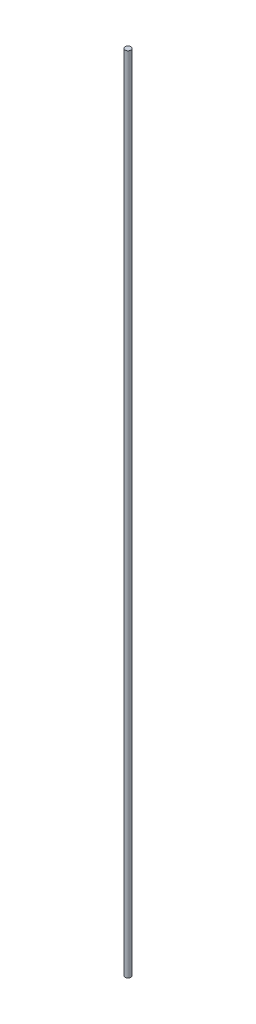
ISO-10303-21;
HEADER;
FILE_DESCRIPTION(('STEP AP214'),'2;1');
FILE_NAME('part.step','',(''),(''),'','','');
FILE_SCHEMA(('AUTOMOTIVE_DESIGN { 1 0 10303 214 1 1 1 1 }'));
ENDSEC;
DATA;
#1=APPLICATION_CONTEXT('core data for automotive mechanical design processes');
#2=APPLICATION_PROTOCOL_DEFINITION('international standard','automotive_design',2000,#1);
#3=PRODUCT_CONTEXT('',#1,'mechanical');
#4=PRODUCT('Part','Part','',(#3));
#5=PRODUCT_RELATED_PRODUCT_CATEGORY('part','',(#4));
#6=PRODUCT_DEFINITION_FORMATION('','',#4);
#7=PRODUCT_DEFINITION_CONTEXT('part definition',#1,'design');
#8=PRODUCT_DEFINITION('design','',#6,#7);
#9=PRODUCT_DEFINITION_SHAPE('','',#8);
#10=(LENGTH_UNIT() NAMED_UNIT(*) SI_UNIT(.MILLI.,.METRE.));
#11=(NAMED_UNIT(*) PLANE_ANGLE_UNIT() SI_UNIT($,.RADIAN.));
#12=(NAMED_UNIT(*) SI_UNIT($,.STERADIAN.) SOLID_ANGLE_UNIT());
#13=UNCERTAINTY_MEASURE_WITH_UNIT(LENGTH_MEASURE(1.E-05),#10,'distance_accuracy_value','');
#14=(GEOMETRIC_REPRESENTATION_CONTEXT(3) GLOBAL_UNCERTAINTY_ASSIGNED_CONTEXT((#13)) GLOBAL_UNIT_ASSIGNED_CONTEXT((#10,
#11,#12)) REPRESENTATION_CONTEXT('',''));
#15=CARTESIAN_POINT('',(0.,0.,0.));
#16=DIRECTION('',(0.,0.,1.));
#17=DIRECTION('',(1.,0.,0.));
#18=AXIS2_PLACEMENT_3D('',#15,#16,#17);
#19=CARTESIAN_POINT('',(0.,1092.5,0.));
#20=DIRECTION('',(0.,-1.,0.));
#21=DIRECTION('',(0.,0.,-1.));
#22=AXIS2_PLACEMENT_3D('',#19,#20,#21);
#23=CYLINDRICAL_SURFACE('',#22,4.);
#24=CARTESIAN_POINT('',(0.,1092.5,0.));
#25=DIRECTION('',(0.,1.,0.));
#26=DIRECTION('',(0.,0.,1.));
#27=AXIS2_PLACEMENT_3D('',#24,#25,#26);
#28=CIRCLE('',#27,4.);
#29=CARTESIAN_POINT('',(0.,1092.5,4.));
#30=VERTEX_POINT('',#29);
#31=EDGE_CURVE('E10',#30,#30,#28,.T.);
#32=ORIENTED_EDGE('',*,*,#31,.F.);
#33=EDGE_LOOP('',(#32));
#34=FACE_BOUND('',#33,.T.);
#35=CARTESIAN_POINT('',(0.,0.,0.));
#36=DIRECTION('',(0.,1.,0.));
#37=DIRECTION('',(0.,0.,1.));
#38=AXIS2_PLACEMENT_3D('',#35,#36,#37);
#39=CIRCLE('',#38,4.);
#40=CARTESIAN_POINT('',(0.,0.,4.));
#41=VERTEX_POINT('',#40);
#42=EDGE_CURVE('E36',#41,#41,#39,.T.);
#43=ORIENTED_EDGE('',*,*,#42,.T.);
#44=EDGE_LOOP('',(#43));
#45=FACE_BOUND('',#44,.T.);
#46=ADVANCED_FACE('F33',(#34,#45),#23,.T.);
#47=CARTESIAN_POINT('',(0.,1092.5,0.));
#48=DIRECTION('',(0.,1.,0.));
#49=DIRECTION('',(0.,0.,1.));
#50=AXIS2_PLACEMENT_3D('',#47,#48,#49);
#51=PLANE('',#50);
#52=ORIENTED_EDGE('',*,*,#31,.T.);
#53=EDGE_LOOP('',(#52));
#54=FACE_BOUND('',#53,.T.);
#55=ADVANCED_FACE('F48',(#54),#51,.T.);
#56=CARTESIAN_POINT('',(0.,0.,0.));
#57=DIRECTION('',(0.,1.,0.));
#58=DIRECTION('',(0.,0.,1.));
#59=AXIS2_PLACEMENT_3D('',#56,#57,#58);
#60=PLANE('',#59);
#61=ORIENTED_EDGE('',*,*,#42,.F.);
#62=EDGE_LOOP('',(#61));
#63=FACE_BOUND('',#62,.T.);
#64=ADVANCED_FACE('F46',(#63),#60,.F.);
#65=CLOSED_SHELL('',(#46,#55,#64));
#66=MANIFOLD_SOLID_BREP('B2',#65);
#67=ADVANCED_BREP_SHAPE_REPRESENTATION('',(#18,#66),#14);
#68=SHAPE_DEFINITION_REPRESENTATION(#9,#67);
ENDSEC;
END-ISO-10303-21;
